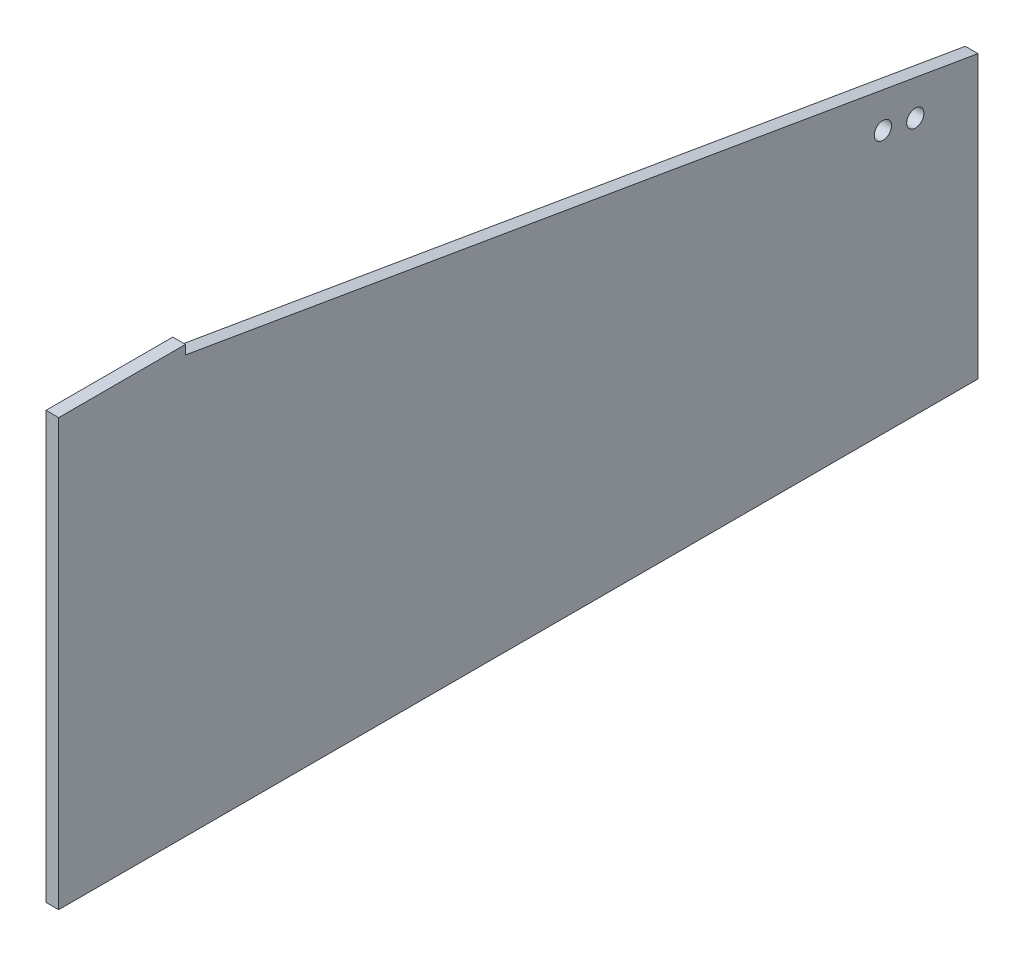
ISO-10303-21;
HEADER;
FILE_DESCRIPTION(('STEP AP214'),'2;1');
FILE_NAME('part.step','',(''),(''),'','','');
FILE_SCHEMA(('AUTOMOTIVE_DESIGN { 1 0 10303 214 1 1 1 1 }'));
ENDSEC;
DATA;
#1=APPLICATION_CONTEXT('core data for automotive mechanical design processes');
#2=APPLICATION_PROTOCOL_DEFINITION('international standard','automotive_design',2000,#1);
#3=PRODUCT_CONTEXT('',#1,'mechanical');
#4=PRODUCT('Part','Part','',(#3));
#5=PRODUCT_RELATED_PRODUCT_CATEGORY('part','',(#4));
#6=PRODUCT_DEFINITION_FORMATION('','',#4);
#7=PRODUCT_DEFINITION_CONTEXT('part definition',#1,'design');
#8=PRODUCT_DEFINITION('design','',#6,#7);
#9=PRODUCT_DEFINITION_SHAPE('','',#8);
#10=(LENGTH_UNIT() NAMED_UNIT(*) SI_UNIT(.MILLI.,.METRE.));
#11=(NAMED_UNIT(*) PLANE_ANGLE_UNIT() SI_UNIT($,.RADIAN.));
#12=(NAMED_UNIT(*) SI_UNIT($,.STERADIAN.) SOLID_ANGLE_UNIT());
#13=UNCERTAINTY_MEASURE_WITH_UNIT(LENGTH_MEASURE(1.E-05),#10,'distance_accuracy_value','');
#14=(GEOMETRIC_REPRESENTATION_CONTEXT(3) GLOBAL_UNCERTAINTY_ASSIGNED_CONTEXT((#13)) GLOBAL_UNIT_ASSIGNED_CONTEXT((#10,
#11,#12)) REPRESENTATION_CONTEXT('',''));
#15=CARTESIAN_POINT('',(0.,0.,0.));
#16=DIRECTION('',(0.,0.,1.));
#17=DIRECTION('',(1.,0.,0.));
#18=AXIS2_PLACEMENT_3D('',#15,#16,#17);
#19=CARTESIAN_POINT('',(18.,0.,0.));
#20=DIRECTION('',(-1.,0.,0.));
#21=DIRECTION('',(0.,0.,1.));
#22=AXIS2_PLACEMENT_3D('',#19,#20,#21);
#23=PLANE('',#22);
#24=DIRECTION('',(0.,0.,-1.));
#25=VECTOR('',#24,1.);
#26=CARTESIAN_POINT('',(18.,0.,-1305.));
#27=LINE('',#26,#25);
#28=CARTESIAN_POINT('',(18.,0.,0.));
#29=VERTEX_POINT('',#28);
#30=CARTESIAN_POINT('',(18.,0.,-1305.));
#31=VERTEX_POINT('',#30);
#32=EDGE_CURVE('E131',#29,#31,#27,.T.);
#33=ORIENTED_EDGE('',*,*,#32,.T.);
#34=DIRECTION('',(0.,1.,0.));
#35=VECTOR('',#34,1.);
#36=CARTESIAN_POINT('',(18.,400.,-1305.));
#37=LINE('',#36,#35);
#38=CARTESIAN_POINT('',(18.,400.,-1305.));
#39=VERTEX_POINT('',#38);
#40=EDGE_CURVE('E89',#31,#39,#37,.T.);
#41=ORIENTED_EDGE('',*,*,#40,.T.);
#42=DIRECTION('',(0.,0.168234164861202,0.985747059733608));
#43=VECTOR('',#42,1.);
#44=CARTESIAN_POINT('',(18.,592.,-180.));
#45=LINE('',#44,#43);
#46=CARTESIAN_POINT('',(18.,592.,-180.));
#47=VERTEX_POINT('',#46);
#48=EDGE_CURVE('E102',#39,#47,#45,.T.);
#49=ORIENTED_EDGE('',*,*,#48,.T.);
#50=DIRECTION('',(0.,1.,0.));
#51=VECTOR('',#50,1.);
#52=CARTESIAN_POINT('',(18.,605.,-180.));
#53=LINE('',#52,#51);
#54=CARTESIAN_POINT('',(18.,605.,-180.));
#55=VERTEX_POINT('',#54);
#56=EDGE_CURVE('E96',#47,#55,#53,.T.);
#57=ORIENTED_EDGE('',*,*,#56,.T.);
#58=DIRECTION('',(0.,0.,1.));
#59=VECTOR('',#58,1.);
#60=CARTESIAN_POINT('',(18.,605.,0.));
#61=LINE('',#60,#59);
#62=CARTESIAN_POINT('',(18.,605.,0.));
#63=VERTEX_POINT('',#62);
#64=EDGE_CURVE('E100',#55,#63,#61,.T.);
#65=ORIENTED_EDGE('',*,*,#64,.T.);
#66=DIRECTION('',(0.,-1.,0.));
#67=VECTOR('',#66,1.);
#68=CARTESIAN_POINT('',(18.,0.,0.));
#69=LINE('',#68,#67);
#70=EDGE_CURVE('E52',#63,#29,#69,.T.);
#71=ORIENTED_EDGE('',*,*,#70,.T.);
#72=EDGE_LOOP('',(#33,#41,#49,#57,#65,#71));
#73=FACE_BOUND('',#72,.T.);
#74=CARTESIAN_POINT('',(18.,365.189333333333,-1216.));
#75=DIRECTION('',(1.,0.,0.));
#76=DIRECTION('',(0.,0.,-1.));
#77=AXIS2_PLACEMENT_3D('',#74,#75,#76);
#78=CIRCLE('',#77,12.25);
#79=CARTESIAN_POINT('',(18.,365.189333333333,-1228.25));
#80=VERTEX_POINT('',#79);
#81=EDGE_CURVE('E124',#80,#80,#78,.T.);
#82=ORIENTED_EDGE('',*,*,#81,.F.);
#83=EDGE_LOOP('',(#82));
#84=FACE_BOUND('',#83,.T.);
#85=CARTESIAN_POINT('',(18.,373.04,-1170.));
#86=DIRECTION('',(1.,0.,0.));
#87=DIRECTION('',(0.,0.,-1.));
#88=AXIS2_PLACEMENT_3D('',#85,#86,#87);
#89=CIRCLE('',#88,12.25);
#90=CARTESIAN_POINT('',(18.,373.04,-1182.25));
#91=VERTEX_POINT('',#90);
#92=EDGE_CURVE('E172',#91,#91,#89,.T.);
#93=ORIENTED_EDGE('',*,*,#92,.F.);
#94=EDGE_LOOP('',(#93));
#95=FACE_BOUND('',#94,.T.);
#96=ADVANCED_FACE('F35',(#73,#84,#95),#23,.F.);
#97=CARTESIAN_POINT('',(0.,0.,0.));
#98=DIRECTION('',(-1.,0.,0.));
#99=DIRECTION('',(0.,0.,1.));
#100=AXIS2_PLACEMENT_3D('',#97,#98,#99);
#101=PLANE('',#100);
#102=CARTESIAN_POINT('',(0.,365.189333333333,-1216.));
#103=DIRECTION('',(1.,0.,0.));
#104=DIRECTION('',(0.,0.,-1.));
#105=AXIS2_PLACEMENT_3D('',#102,#103,#104);
#106=CIRCLE('',#105,12.25);
#107=CARTESIAN_POINT('',(0.,365.189333333333,-1228.25));
#108=VERTEX_POINT('',#107);
#109=EDGE_CURVE('E177',#108,#108,#106,.T.);
#110=ORIENTED_EDGE('',*,*,#109,.T.);
#111=EDGE_LOOP('',(#110));
#112=FACE_BOUND('',#111,.T.);
#113=DIRECTION('',(0.,0.,-1.));
#114=VECTOR('',#113,1.);
#115=CARTESIAN_POINT('',(0.,0.,-1305.));
#116=LINE('',#115,#114);
#117=CARTESIAN_POINT('',(0.,0.,0.));
#118=VERTEX_POINT('',#117);
#119=CARTESIAN_POINT('',(0.,0.,-1305.));
#120=VERTEX_POINT('',#119);
#121=EDGE_CURVE('E120',#118,#120,#116,.T.);
#122=ORIENTED_EDGE('',*,*,#121,.F.);
#123=DIRECTION('',(0.,-1.,0.));
#124=VECTOR('',#123,1.);
#125=CARTESIAN_POINT('',(0.,0.,0.));
#126=LINE('',#125,#124);
#127=CARTESIAN_POINT('',(0.,605.,0.));
#128=VERTEX_POINT('',#127);
#129=EDGE_CURVE('E81',#128,#118,#126,.T.);
#130=ORIENTED_EDGE('',*,*,#129,.F.);
#131=DIRECTION('',(0.,0.,1.));
#132=VECTOR('',#131,1.);
#133=CARTESIAN_POINT('',(0.,605.,0.));
#134=LINE('',#133,#132);
#135=CARTESIAN_POINT('',(0.,605.,-180.));
#136=VERTEX_POINT('',#135);
#137=EDGE_CURVE('E75',#136,#128,#134,.T.);
#138=ORIENTED_EDGE('',*,*,#137,.F.);
#139=DIRECTION('',(0.,1.,0.));
#140=VECTOR('',#139,1.);
#141=CARTESIAN_POINT('',(0.,605.,-180.));
#142=LINE('',#141,#140);
#143=CARTESIAN_POINT('',(0.,592.,-180.));
#144=VERTEX_POINT('',#143);
#145=EDGE_CURVE('E110',#144,#136,#142,.T.);
#146=ORIENTED_EDGE('',*,*,#145,.F.);
#147=DIRECTION('',(0.,0.168234164861202,0.985747059733608));
#148=VECTOR('',#147,1.);
#149=CARTESIAN_POINT('',(0.,592.,-180.));
#150=LINE('',#149,#148);
#151=CARTESIAN_POINT('',(0.,400.,-1305.));
#152=VERTEX_POINT('',#151);
#153=EDGE_CURVE('E126',#152,#144,#150,.T.);
#154=ORIENTED_EDGE('',*,*,#153,.F.);
#155=DIRECTION('',(0.,1.,0.));
#156=VECTOR('',#155,1.);
#157=CARTESIAN_POINT('',(0.,400.,-1305.));
#158=LINE('',#157,#156);
#159=EDGE_CURVE('E123',#120,#152,#158,.T.);
#160=ORIENTED_EDGE('',*,*,#159,.F.);
#161=EDGE_LOOP('',(#122,#130,#138,#146,#154,#160));
#162=FACE_BOUND('',#161,.T.);
#163=CARTESIAN_POINT('',(0.,373.04,-1170.));
#164=DIRECTION('',(1.,0.,0.));
#165=DIRECTION('',(0.,0.,-1.));
#166=AXIS2_PLACEMENT_3D('',#163,#164,#165);
#167=CIRCLE('',#166,12.25);
#168=CARTESIAN_POINT('',(0.,373.04,-1182.25));
#169=VERTEX_POINT('',#168);
#170=EDGE_CURVE('E175',#169,#169,#167,.T.);
#171=ORIENTED_EDGE('',*,*,#170,.T.);
#172=EDGE_LOOP('',(#171));
#173=FACE_BOUND('',#172,.T.);
#174=ADVANCED_FACE('F140',(#112,#162,#173),#101,.T.);
#175=CARTESIAN_POINT('',(18.,0.,-1305.));
#176=DIRECTION('',(0.,1.,0.));
#177=DIRECTION('',(0.,0.,1.));
#178=AXIS2_PLACEMENT_3D('',#175,#176,#177);
#179=PLANE('',#178);
#180=ORIENTED_EDGE('',*,*,#121,.T.);
#181=DIRECTION('',(-1.,0.,0.));
#182=VECTOR('',#181,1.);
#183=CARTESIAN_POINT('',(18.,0.,-1305.));
#184=LINE('',#183,#182);
#185=EDGE_CURVE('E11',#31,#120,#184,.T.);
#186=ORIENTED_EDGE('',*,*,#185,.F.);
#187=ORIENTED_EDGE('',*,*,#32,.F.);
#188=DIRECTION('',(-1.,0.,0.));
#189=VECTOR('',#188,1.);
#190=CARTESIAN_POINT('',(18.,0.,0.));
#191=LINE('',#190,#189);
#192=EDGE_CURVE('E116',#29,#118,#191,.T.);
#193=ORIENTED_EDGE('',*,*,#192,.T.);
#194=EDGE_LOOP('',(#180,#186,#187,#193));
#195=FACE_BOUND('',#194,.T.);
#196=ADVANCED_FACE('F37',(#195),#179,.F.);
#197=CARTESIAN_POINT('',(18.,400.,-1305.));
#198=DIRECTION('',(0.,0.,1.));
#199=DIRECTION('',(1.,0.,0.));
#200=AXIS2_PLACEMENT_3D('',#197,#198,#199);
#201=PLANE('',#200);
#202=ORIENTED_EDGE('',*,*,#159,.T.);
#203=DIRECTION('',(-1.,0.,0.));
#204=VECTOR('',#203,1.);
#205=CARTESIAN_POINT('',(18.,400.,-1305.));
#206=LINE('',#205,#204);
#207=EDGE_CURVE('E44',#39,#152,#206,.T.);
#208=ORIENTED_EDGE('',*,*,#207,.F.);
#209=ORIENTED_EDGE('',*,*,#40,.F.);
#210=ORIENTED_EDGE('',*,*,#185,.T.);
#211=EDGE_LOOP('',(#202,#208,#209,#210));
#212=FACE_BOUND('',#211,.T.);
#213=ADVANCED_FACE('F207',(#212),#201,.F.);
#214=CARTESIAN_POINT('',(18.,592.,-180.));
#215=DIRECTION('',(0.,-0.985747059733608,0.168234164861202));
#216=DIRECTION('',(0.,-0.168234164861202,-0.985747059733608));
#217=AXIS2_PLACEMENT_3D('',#214,#215,#216);
#218=PLANE('',#217);
#219=ORIENTED_EDGE('',*,*,#153,.T.);
#220=DIRECTION('',(-1.,0.,0.));
#221=VECTOR('',#220,1.);
#222=CARTESIAN_POINT('',(18.,592.,-180.));
#223=LINE('',#222,#221);
#224=EDGE_CURVE('E111',#47,#144,#223,.T.);
#225=ORIENTED_EDGE('',*,*,#224,.F.);
#226=ORIENTED_EDGE('',*,*,#48,.F.);
#227=ORIENTED_EDGE('',*,*,#207,.T.);
#228=EDGE_LOOP('',(#219,#225,#226,#227));
#229=FACE_BOUND('',#228,.T.);
#230=ADVANCED_FACE('F137',(#229),#218,.F.);
#231=CARTESIAN_POINT('',(18.,605.,-180.));
#232=DIRECTION('',(0.,0.,1.));
#233=DIRECTION('',(1.,0.,0.));
#234=AXIS2_PLACEMENT_3D('',#231,#232,#233);
#235=PLANE('',#234);
#236=ORIENTED_EDGE('',*,*,#145,.T.);
#237=DIRECTION('',(-1.,0.,0.));
#238=VECTOR('',#237,1.);
#239=CARTESIAN_POINT('',(18.,605.,-180.));
#240=LINE('',#239,#238);
#241=EDGE_CURVE('E107',#55,#136,#240,.T.);
#242=ORIENTED_EDGE('',*,*,#241,.F.);
#243=ORIENTED_EDGE('',*,*,#56,.F.);
#244=ORIENTED_EDGE('',*,*,#224,.T.);
#245=EDGE_LOOP('',(#236,#242,#243,#244));
#246=FACE_BOUND('',#245,.T.);
#247=ADVANCED_FACE('F108',(#246),#235,.F.);
#248=CARTESIAN_POINT('',(18.,605.,0.));
#249=DIRECTION('',(0.,-1.,0.));
#250=DIRECTION('',(0.,0.,-1.));
#251=AXIS2_PLACEMENT_3D('',#248,#249,#250);
#252=PLANE('',#251);
#253=ORIENTED_EDGE('',*,*,#137,.T.);
#254=DIRECTION('',(-1.,0.,0.));
#255=VECTOR('',#254,1.);
#256=CARTESIAN_POINT('',(18.,605.,0.));
#257=LINE('',#256,#255);
#258=EDGE_CURVE('E112',#63,#128,#257,.T.);
#259=ORIENTED_EDGE('',*,*,#258,.F.);
#260=ORIENTED_EDGE('',*,*,#64,.F.);
#261=ORIENTED_EDGE('',*,*,#241,.T.);
#262=EDGE_LOOP('',(#253,#259,#260,#261));
#263=FACE_BOUND('',#262,.T.);
#264=ADVANCED_FACE('F114',(#263),#252,.F.);
#265=CARTESIAN_POINT('',(18.,0.,0.));
#266=DIRECTION('',(0.,0.,-1.));
#267=DIRECTION('',(-1.,0.,0.));
#268=AXIS2_PLACEMENT_3D('',#265,#266,#267);
#269=PLANE('',#268);
#270=ORIENTED_EDGE('',*,*,#129,.T.);
#271=ORIENTED_EDGE('',*,*,#192,.F.);
#272=ORIENTED_EDGE('',*,*,#70,.F.);
#273=ORIENTED_EDGE('',*,*,#258,.T.);
#274=EDGE_LOOP('',(#270,#271,#272,#273));
#275=FACE_BOUND('',#274,.T.);
#276=ADVANCED_FACE('F145',(#275),#269,.F.);
#277=CARTESIAN_POINT('',(18.,365.189333333333,-1216.));
#278=DIRECTION('',(-1.,0.,0.));
#279=DIRECTION('',(0.,0.,1.));
#280=AXIS2_PLACEMENT_3D('',#277,#278,#279);
#281=CYLINDRICAL_SURFACE('',#280,12.25);
#282=ORIENTED_EDGE('',*,*,#81,.T.);
#283=EDGE_LOOP('',(#282));
#284=FACE_BOUND('',#283,.T.);
#285=ORIENTED_EDGE('',*,*,#109,.F.);
#286=EDGE_LOOP('',(#285));
#287=FACE_BOUND('',#286,.T.);
#288=ADVANCED_FACE('F147',(#284,#287),#281,.F.);
#289=CARTESIAN_POINT('',(18.,373.04,-1170.));
#290=DIRECTION('',(-1.,0.,0.));
#291=DIRECTION('',(0.,0.,1.));
#292=AXIS2_PLACEMENT_3D('',#289,#290,#291);
#293=CYLINDRICAL_SURFACE('',#292,12.25);
#294=ORIENTED_EDGE('',*,*,#92,.T.);
#295=EDGE_LOOP('',(#294));
#296=FACE_BOUND('',#295,.T.);
#297=ORIENTED_EDGE('',*,*,#170,.F.);
#298=EDGE_LOOP('',(#297));
#299=FACE_BOUND('',#298,.T.);
#300=ADVANCED_FACE('F153',(#296,#299),#293,.F.);
#301=CLOSED_SHELL('',(#96,#174,#196,#213,#230,#247,#264,#276,#288,#300));
#302=MANIFOLD_SOLID_BREP('B2',#301);
#303=ADVANCED_BREP_SHAPE_REPRESENTATION('',(#18,#302),#14);
#304=SHAPE_DEFINITION_REPRESENTATION(#9,#303);
ENDSEC;
END-ISO-10303-21;
